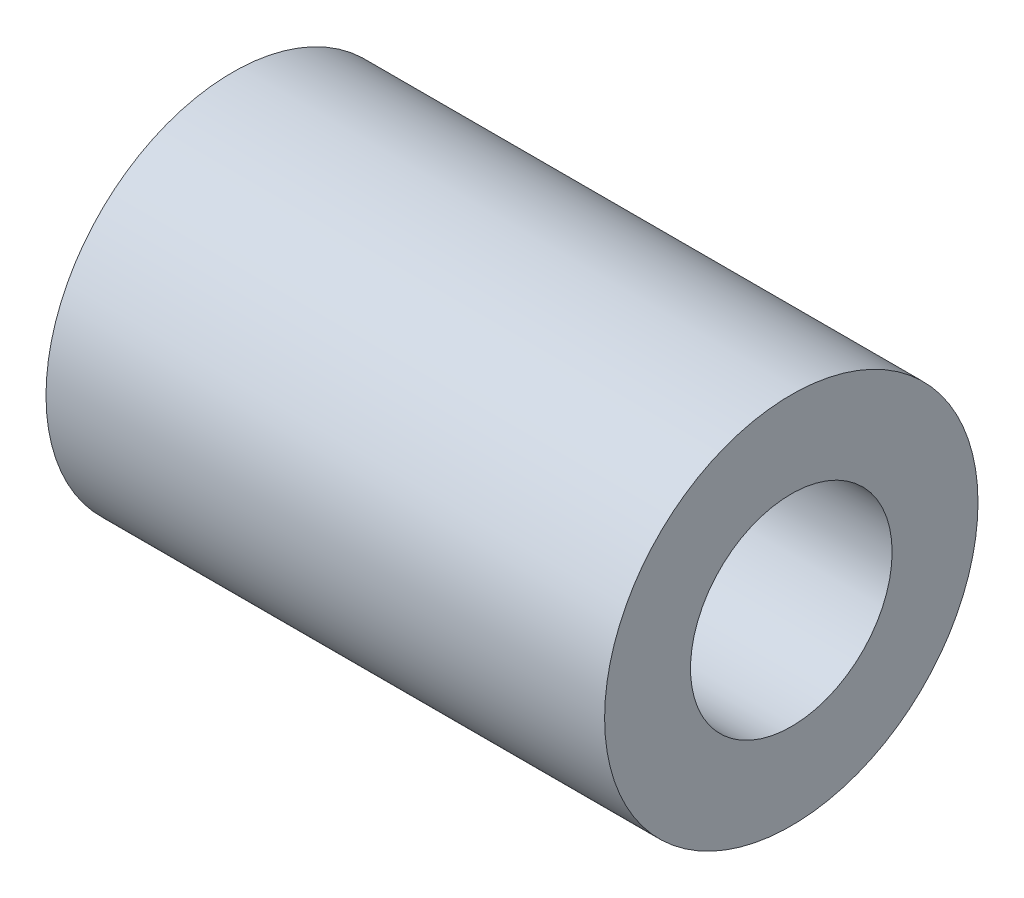
ISO-10303-21;
HEADER;
FILE_DESCRIPTION(('STEP AP214'),'2;1');
FILE_NAME('part.step','',(''),(''),'','','');
FILE_SCHEMA(('AUTOMOTIVE_DESIGN { 1 0 10303 214 1 1 1 1 }'));
ENDSEC;
DATA;
#1=APPLICATION_CONTEXT('core data for automotive mechanical design processes');
#2=APPLICATION_PROTOCOL_DEFINITION('international standard','automotive_design',2000,#1);
#3=PRODUCT_CONTEXT('',#1,'mechanical');
#4=PRODUCT('Part','Part','',(#3));
#5=PRODUCT_RELATED_PRODUCT_CATEGORY('part','',(#4));
#6=PRODUCT_DEFINITION_FORMATION('','',#4);
#7=PRODUCT_DEFINITION_CONTEXT('part definition',#1,'design');
#8=PRODUCT_DEFINITION('design','',#6,#7);
#9=PRODUCT_DEFINITION_SHAPE('','',#8);
#10=(LENGTH_UNIT() NAMED_UNIT(*) SI_UNIT(.MILLI.,.METRE.));
#11=(NAMED_UNIT(*) PLANE_ANGLE_UNIT() SI_UNIT($,.RADIAN.));
#12=(NAMED_UNIT(*) SI_UNIT($,.STERADIAN.) SOLID_ANGLE_UNIT());
#13=UNCERTAINTY_MEASURE_WITH_UNIT(LENGTH_MEASURE(1.E-05),#10,'distance_accuracy_value','');
#14=(GEOMETRIC_REPRESENTATION_CONTEXT(3) GLOBAL_UNCERTAINTY_ASSIGNED_CONTEXT((#13)) GLOBAL_UNIT_ASSIGNED_CONTEXT((#10,
#11,#12)) REPRESENTATION_CONTEXT('',''));
#15=CARTESIAN_POINT('',(0.,0.,0.));
#16=DIRECTION('',(0.,0.,1.));
#17=DIRECTION('',(1.,0.,0.));
#18=AXIS2_PLACEMENT_3D('',#15,#16,#17);
#19=CARTESIAN_POINT('',(-19.,0.,0.));
#20=DIRECTION('',(1.,0.,0.));
#21=DIRECTION('',(0.,0.,-1.));
#22=AXIS2_PLACEMENT_3D('',#19,#20,#21);
#23=CYLINDRICAL_SURFACE('',#22,6.35);
#24=CARTESIAN_POINT('',(-19.,0.,0.));
#25=DIRECTION('',(1.,0.,0.));
#26=DIRECTION('',(0.,0.,-1.));
#27=AXIS2_PLACEMENT_3D('',#24,#25,#26);
#28=CIRCLE('',#27,6.35);
#29=CARTESIAN_POINT('',(-19.,0.,-6.35));
#30=VERTEX_POINT('',#29);
#31=EDGE_CURVE('E10',#30,#30,#28,.T.);
#32=ORIENTED_EDGE('',*,*,#31,.T.);
#33=EDGE_LOOP('',(#32));
#34=FACE_BOUND('',#33,.T.);
#35=CARTESIAN_POINT('',(0.,0.,0.));
#36=DIRECTION('',(1.,0.,0.));
#37=DIRECTION('',(0.,0.,-1.));
#38=AXIS2_PLACEMENT_3D('',#35,#36,#37);
#39=CIRCLE('',#38,6.35);
#40=CARTESIAN_POINT('',(0.,0.,-6.35));
#41=VERTEX_POINT('',#40);
#42=EDGE_CURVE('E34',#41,#41,#39,.T.);
#43=ORIENTED_EDGE('',*,*,#42,.F.);
#44=EDGE_LOOP('',(#43));
#45=FACE_BOUND('',#44,.T.);
#46=ADVANCED_FACE('F31',(#34,#45),#23,.T.);
#47=CARTESIAN_POINT('',(-19.,0.,0.));
#48=DIRECTION('',(1.,0.,0.));
#49=DIRECTION('',(0.,0.,-1.));
#50=AXIS2_PLACEMENT_3D('',#47,#48,#49);
#51=PLANE('',#50);
#52=CARTESIAN_POINT('',(-19.,0.,0.));
#53=DIRECTION('',(1.,0.,0.));
#54=DIRECTION('',(0.,0.,-1.));
#55=AXIS2_PLACEMENT_3D('',#52,#53,#54);
#56=CIRCLE('',#55,3.429);
#57=CARTESIAN_POINT('',(-19.,0.,-3.429));
#58=VERTEX_POINT('',#57);
#59=EDGE_CURVE('E41',#58,#58,#56,.T.);
#60=ORIENTED_EDGE('',*,*,#59,.T.);
#61=EDGE_LOOP('',(#60));
#62=FACE_BOUND('',#61,.T.);
#63=ORIENTED_EDGE('',*,*,#31,.F.);
#64=EDGE_LOOP('',(#63));
#65=FACE_BOUND('',#64,.T.);
#66=ADVANCED_FACE('F49',(#62,#65),#51,.F.);
#67=CARTESIAN_POINT('',(0.,0.,0.));
#68=DIRECTION('',(1.,0.,0.));
#69=DIRECTION('',(0.,0.,-1.));
#70=AXIS2_PLACEMENT_3D('',#67,#68,#69);
#71=PLANE('',#70);
#72=CARTESIAN_POINT('',(0.,0.,0.));
#73=DIRECTION('',(1.,0.,0.));
#74=DIRECTION('',(0.,0.,-1.));
#75=AXIS2_PLACEMENT_3D('',#72,#73,#74);
#76=CIRCLE('',#75,3.429);
#77=CARTESIAN_POINT('',(0.,0.,-3.429));
#78=VERTEX_POINT('',#77);
#79=EDGE_CURVE('E43',#78,#78,#76,.T.);
#80=ORIENTED_EDGE('',*,*,#79,.F.);
#81=EDGE_LOOP('',(#80));
#82=FACE_BOUND('',#81,.T.);
#83=ORIENTED_EDGE('',*,*,#42,.T.);
#84=EDGE_LOOP('',(#83));
#85=FACE_BOUND('',#84,.T.);
#86=ADVANCED_FACE('F55',(#82,#85),#71,.T.);
#87=CARTESIAN_POINT('',(-19.,0.,0.));
#88=DIRECTION('',(1.,0.,0.));
#89=DIRECTION('',(0.,0.,-1.));
#90=AXIS2_PLACEMENT_3D('',#87,#88,#89);
#91=CYLINDRICAL_SURFACE('',#90,3.429);
#92=ORIENTED_EDGE('',*,*,#59,.F.);
#93=EDGE_LOOP('',(#92));
#94=FACE_BOUND('',#93,.T.);
#95=ORIENTED_EDGE('',*,*,#79,.T.);
#96=EDGE_LOOP('',(#95));
#97=FACE_BOUND('',#96,.T.);
#98=ADVANCED_FACE('F52',(#94,#97),#91,.F.);
#99=CLOSED_SHELL('',(#46,#66,#86,#98));
#100=MANIFOLD_SOLID_BREP('B2',#99);
#101=ADVANCED_BREP_SHAPE_REPRESENTATION('',(#18,#100),#14);
#102=SHAPE_DEFINITION_REPRESENTATION(#9,#101);
ENDSEC;
END-ISO-10303-21;
